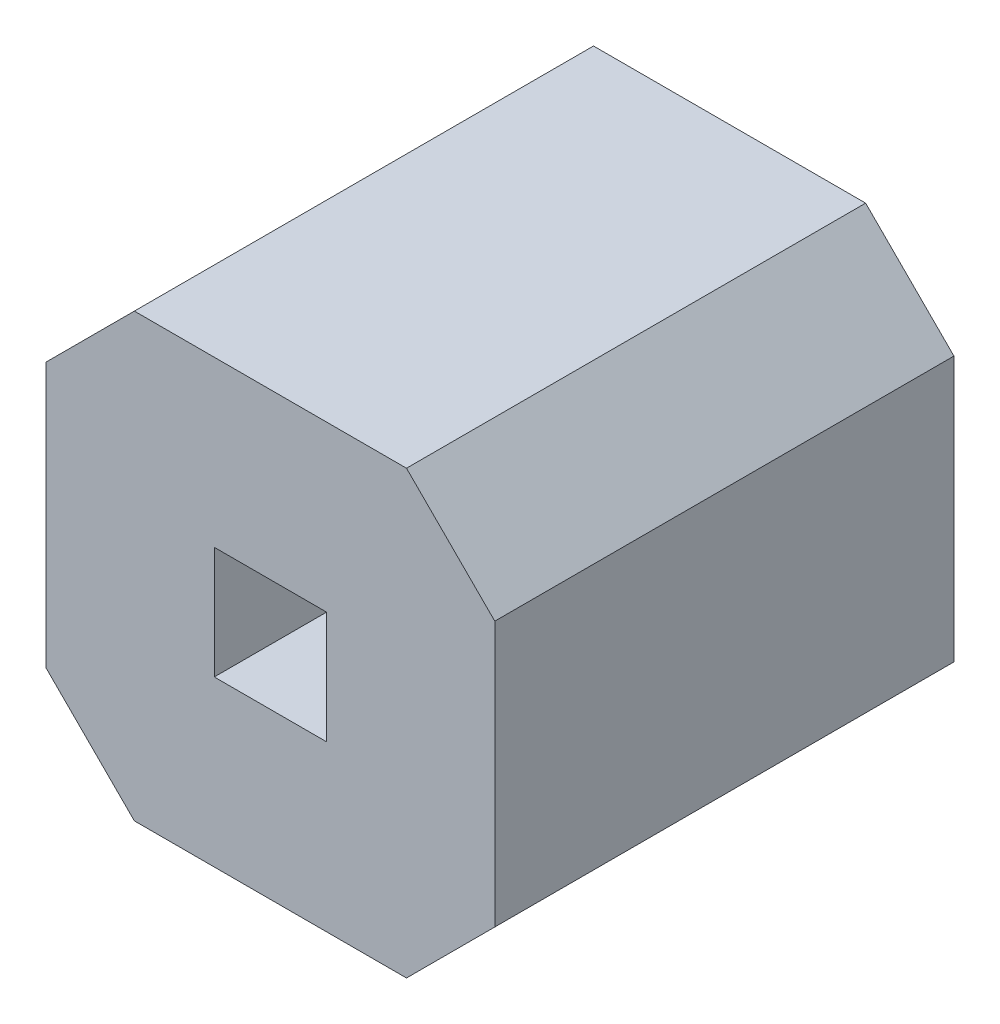
ISO-10303-21;
HEADER;
FILE_DESCRIPTION(('STEP AP214'),'2;1');
FILE_NAME('part.step','',(''),(''),'','','');
FILE_SCHEMA(('AUTOMOTIVE_DESIGN { 1 0 10303 214 1 1 1 1 }'));
ENDSEC;
DATA;
#1=APPLICATION_CONTEXT('core data for automotive mechanical design processes');
#2=APPLICATION_PROTOCOL_DEFINITION('international standard','automotive_design',2000,#1);
#3=PRODUCT_CONTEXT('',#1,'mechanical');
#4=PRODUCT('Part','Part','',(#3));
#5=PRODUCT_RELATED_PRODUCT_CATEGORY('part','',(#4));
#6=PRODUCT_DEFINITION_FORMATION('','',#4);
#7=PRODUCT_DEFINITION_CONTEXT('part definition',#1,'design');
#8=PRODUCT_DEFINITION('design','',#6,#7);
#9=PRODUCT_DEFINITION_SHAPE('','',#8);
#10=(LENGTH_UNIT() NAMED_UNIT(*) SI_UNIT(.MILLI.,.METRE.));
#11=(NAMED_UNIT(*) PLANE_ANGLE_UNIT() SI_UNIT($,.RADIAN.));
#12=(NAMED_UNIT(*) SI_UNIT($,.STERADIAN.) SOLID_ANGLE_UNIT());
#13=UNCERTAINTY_MEASURE_WITH_UNIT(LENGTH_MEASURE(1.E-05),#10,'distance_accuracy_value','');
#14=(GEOMETRIC_REPRESENTATION_CONTEXT(3) GLOBAL_UNCERTAINTY_ASSIGNED_CONTEXT((#13)) GLOBAL_UNIT_ASSIGNED_CONTEXT((#10,
#11,#12)) REPRESENTATION_CONTEXT('',''));
#15=CARTESIAN_POINT('',(0.,0.,0.));
#16=DIRECTION('',(0.,0.,1.));
#17=DIRECTION('',(1.,0.,0.));
#18=AXIS2_PLACEMENT_3D('',#15,#16,#17);
#19=CARTESIAN_POINT('',(0.,0.,2.6));
#20=DIRECTION('',(0.,0.,1.));
#21=DIRECTION('',(1.,0.,0.));
#22=AXIS2_PLACEMENT_3D('',#19,#20,#21);
#23=PLANE('',#22);
#24=DIRECTION('',(1.,0.,0.));
#25=VECTOR('',#24,1.);
#26=CARTESIAN_POINT('',(0.,-2.5,2.6));
#27=LINE('',#26,#25);
#28=CARTESIAN_POINT('',(0.499999999999999,-2.5,2.6));
#29=VERTEX_POINT('',#28);
#30=CARTESIAN_POINT('',(2.041,-2.5,2.6));
#31=VERTEX_POINT('',#30);
#32=EDGE_CURVE('E172',#29,#31,#27,.T.);
#33=ORIENTED_EDGE('',*,*,#32,.T.);
#34=DIRECTION('',(-0.707106781186549,-0.707106781186546,0.));
#35=VECTOR('',#34,1.);
#36=CARTESIAN_POINT('',(2.2705,-2.2705,2.6));
#37=LINE('',#36,#35);
#38=CARTESIAN_POINT('',(2.541,-2.,2.6));
#39=VERTEX_POINT('',#38);
#40=EDGE_CURVE('E212',#31,#39,#37,.F.);
#41=ORIENTED_EDGE('',*,*,#40,.T.);
#42=DIRECTION('',(0.,1.,0.));
#43=VECTOR('',#42,1.);
#44=CARTESIAN_POINT('',(2.541,0.,2.6));
#45=LINE('',#44,#43);
#46=CARTESIAN_POINT('',(2.541,-0.500000000000001,2.6));
#47=VERTEX_POINT('',#46);
#48=EDGE_CURVE('E176',#39,#47,#45,.T.);
#49=ORIENTED_EDGE('',*,*,#48,.T.);
#50=DIRECTION('',(0.707106781186546,-0.707106781186549,0.));
#51=VECTOR('',#50,1.);
#52=CARTESIAN_POINT('',(1.0205,1.0205,2.6));
#53=LINE('',#52,#51);
#54=CARTESIAN_POINT('',(2.041,0.,2.6));
#55=VERTEX_POINT('',#54);
#56=EDGE_CURVE('E59',#47,#55,#53,.F.);
#57=ORIENTED_EDGE('',*,*,#56,.T.);
#58=DIRECTION('',(-1.,0.,0.));
#59=VECTOR('',#58,1.);
#60=CARTESIAN_POINT('',(0.,0.,2.6));
#61=LINE('',#60,#59);
#62=CARTESIAN_POINT('',(0.500000000000001,0.,2.6));
#63=VERTEX_POINT('',#62);
#64=EDGE_CURVE('E178',#55,#63,#61,.T.);
#65=ORIENTED_EDGE('',*,*,#64,.T.);
#66=DIRECTION('',(0.707106781186549,0.707106781186546,0.));
#67=VECTOR('',#66,1.);
#68=CARTESIAN_POINT('',(0.25,-0.25,2.6));
#69=LINE('',#68,#67);
#70=CARTESIAN_POINT('',(0.,-0.499999999999999,2.6));
#71=VERTEX_POINT('',#70);
#72=EDGE_CURVE('E207',#63,#71,#69,.F.);
#73=ORIENTED_EDGE('',*,*,#72,.T.);
#74=DIRECTION('',(0.,-1.,0.));
#75=VECTOR('',#74,1.);
#76=CARTESIAN_POINT('',(0.,0.,2.6));
#77=LINE('',#76,#75);
#78=CARTESIAN_POINT('',(0.,-2.,2.6));
#79=VERTEX_POINT('',#78);
#80=EDGE_CURVE('E169',#71,#79,#77,.T.);
#81=ORIENTED_EDGE('',*,*,#80,.T.);
#82=DIRECTION('',(-0.707106781186546,0.707106781186549,0.));
#83=VECTOR('',#82,1.);
#84=CARTESIAN_POINT('',(-1.,-0.999999999999996,2.6));
#85=LINE('',#84,#83);
#86=EDGE_CURVE('E209',#79,#29,#85,.F.);
#87=ORIENTED_EDGE('',*,*,#86,.T.);
#88=EDGE_LOOP('',(#33,#41,#49,#57,#65,#73,#81,#87));
#89=FACE_BOUND('',#88,.T.);
#90=DIRECTION('',(1.,0.,0.));
#91=VECTOR('',#90,1.);
#92=CARTESIAN_POINT('',(0.9525,-1.568,2.6));
#93=LINE('',#92,#91);
#94=CARTESIAN_POINT('',(0.9525,-1.568,2.6));
#95=VERTEX_POINT('',#94);
#96=CARTESIAN_POINT('',(1.5885,-1.568,2.6));
#97=VERTEX_POINT('',#96);
#98=EDGE_CURVE('E138',#95,#97,#93,.T.);
#99=ORIENTED_EDGE('',*,*,#98,.F.);
#100=DIRECTION('',(0.,-1.,0.));
#101=VECTOR('',#100,1.);
#102=CARTESIAN_POINT('',(0.9525,-0.932,2.6));
#103=LINE('',#102,#101);
#104=CARTESIAN_POINT('',(0.9525,-0.932,2.6));
#105=VERTEX_POINT('',#104);
#106=EDGE_CURVE('E128',#105,#95,#103,.T.);
#107=ORIENTED_EDGE('',*,*,#106,.F.);
#108=DIRECTION('',(-1.,0.,0.));
#109=VECTOR('',#108,1.);
#110=CARTESIAN_POINT('',(0.9525,-0.932,2.6));
#111=LINE('',#110,#109);
#112=CARTESIAN_POINT('',(1.5885,-0.932,2.6));
#113=VERTEX_POINT('',#112);
#114=EDGE_CURVE('E153',#113,#105,#111,.T.);
#115=ORIENTED_EDGE('',*,*,#114,.F.);
#116=DIRECTION('',(0.,1.,0.));
#117=VECTOR('',#116,1.);
#118=CARTESIAN_POINT('',(1.5885,-0.932,2.6));
#119=LINE('',#118,#117);
#120=EDGE_CURVE('E151',#97,#113,#119,.T.);
#121=ORIENTED_EDGE('',*,*,#120,.F.);
#122=EDGE_LOOP('',(#99,#107,#115,#121));
#123=FACE_BOUND('',#122,.T.);
#124=ADVANCED_FACE('F37',(#89,#123),#23,.T.);
#125=CARTESIAN_POINT('',(0.,0.,0.));
#126=DIRECTION('',(0.,0.,1.));
#127=DIRECTION('',(1.,0.,0.));
#128=AXIS2_PLACEMENT_3D('',#125,#126,#127);
#129=PLANE('',#128);
#130=DIRECTION('',(0.,1.,0.));
#131=VECTOR('',#130,1.);
#132=CARTESIAN_POINT('',(2.541,0.,0.));
#133=LINE('',#132,#131);
#134=CARTESIAN_POINT('',(2.541,-2.,0.));
#135=VERTEX_POINT('',#134);
#136=CARTESIAN_POINT('',(2.541,-0.500000000000001,0.));
#137=VERTEX_POINT('',#136);
#138=EDGE_CURVE('E186',#135,#137,#133,.T.);
#139=ORIENTED_EDGE('',*,*,#138,.F.);
#140=DIRECTION('',(0.707106781186549,0.707106781186546,0.));
#141=VECTOR('',#140,1.);
#142=CARTESIAN_POINT('',(2.541,-2.,0.));
#143=LINE('',#142,#141);
#144=CARTESIAN_POINT('',(2.041,-2.5,0.));
#145=VERTEX_POINT('',#144);
#146=EDGE_CURVE('E200',#135,#145,#143,.F.);
#147=ORIENTED_EDGE('',*,*,#146,.T.);
#148=DIRECTION('',(1.,0.,0.));
#149=VECTOR('',#148,1.);
#150=CARTESIAN_POINT('',(0.,-2.5,0.));
#151=LINE('',#150,#149);
#152=CARTESIAN_POINT('',(0.499999999999999,-2.5,0.));
#153=VERTEX_POINT('',#152);
#154=EDGE_CURVE('E183',#153,#145,#151,.T.);
#155=ORIENTED_EDGE('',*,*,#154,.F.);
#156=DIRECTION('',(0.707106781186546,-0.707106781186549,0.));
#157=VECTOR('',#156,1.);
#158=CARTESIAN_POINT('',(0.499999999999999,-2.5,0.));
#159=LINE('',#158,#157);
#160=CARTESIAN_POINT('',(0.,-2.,0.));
#161=VERTEX_POINT('',#160);
#162=EDGE_CURVE('E196',#153,#161,#159,.F.);
#163=ORIENTED_EDGE('',*,*,#162,.T.);
#164=DIRECTION('',(0.,-1.,0.));
#165=VECTOR('',#164,1.);
#166=CARTESIAN_POINT('',(0.,0.,0.));
#167=LINE('',#166,#165);
#168=CARTESIAN_POINT('',(0.,-0.499999999999999,0.));
#169=VERTEX_POINT('',#168);
#170=EDGE_CURVE('E146',#169,#161,#167,.T.);
#171=ORIENTED_EDGE('',*,*,#170,.F.);
#172=DIRECTION('',(-0.707106781186549,-0.707106781186546,0.));
#173=VECTOR('',#172,1.);
#174=CARTESIAN_POINT('',(0.,-0.499999999999999,0.));
#175=LINE('',#174,#173);
#176=CARTESIAN_POINT('',(0.500000000000001,0.,0.));
#177=VERTEX_POINT('',#176);
#178=EDGE_CURVE('E194',#169,#177,#175,.F.);
#179=ORIENTED_EDGE('',*,*,#178,.T.);
#180=DIRECTION('',(-1.,0.,0.));
#181=VECTOR('',#180,1.);
#182=CARTESIAN_POINT('',(0.,0.,0.));
#183=LINE('',#182,#181);
#184=CARTESIAN_POINT('',(2.041,0.,0.));
#185=VERTEX_POINT('',#184);
#186=EDGE_CURVE('E173',#185,#177,#183,.T.);
#187=ORIENTED_EDGE('',*,*,#186,.F.);
#188=DIRECTION('',(-0.707106781186546,0.707106781186549,0.));
#189=VECTOR('',#188,1.);
#190=CARTESIAN_POINT('',(2.041,0.,0.));
#191=LINE('',#190,#189);
#192=EDGE_CURVE('E198',#185,#137,#191,.F.);
#193=ORIENTED_EDGE('',*,*,#192,.T.);
#194=EDGE_LOOP('',(#139,#147,#155,#163,#171,#179,#187,#193));
#195=FACE_BOUND('',#194,.T.);
#196=DIRECTION('',(0.,-1.,0.));
#197=VECTOR('',#196,1.);
#198=CARTESIAN_POINT('',(0.9525,-0.932,0.));
#199=LINE('',#198,#197);
#200=CARTESIAN_POINT('',(0.9525,-0.932,0.));
#201=VERTEX_POINT('',#200);
#202=CARTESIAN_POINT('',(0.9525,-1.568,0.));
#203=VERTEX_POINT('',#202);
#204=EDGE_CURVE('E157',#201,#203,#199,.T.);
#205=ORIENTED_EDGE('',*,*,#204,.T.);
#206=DIRECTION('',(1.,0.,0.));
#207=VECTOR('',#206,1.);
#208=CARTESIAN_POINT('',(0.9525,-1.568,0.));
#209=LINE('',#208,#207);
#210=CARTESIAN_POINT('',(1.5885,-1.568,0.));
#211=VERTEX_POINT('',#210);
#212=EDGE_CURVE('E145',#203,#211,#209,.T.);
#213=ORIENTED_EDGE('',*,*,#212,.T.);
#214=DIRECTION('',(0.,1.,0.));
#215=VECTOR('',#214,1.);
#216=CARTESIAN_POINT('',(1.5885,-0.932,0.));
#217=LINE('',#216,#215);
#218=CARTESIAN_POINT('',(1.5885,-0.932,0.));
#219=VERTEX_POINT('',#218);
#220=EDGE_CURVE('E160',#211,#219,#217,.T.);
#221=ORIENTED_EDGE('',*,*,#220,.T.);
#222=DIRECTION('',(-1.,0.,0.));
#223=VECTOR('',#222,1.);
#224=CARTESIAN_POINT('',(0.9525,-0.932,0.));
#225=LINE('',#224,#223);
#226=EDGE_CURVE('E139',#219,#201,#225,.T.);
#227=ORIENTED_EDGE('',*,*,#226,.T.);
#228=EDGE_LOOP('',(#205,#213,#221,#227));
#229=FACE_BOUND('',#228,.T.);
#230=ADVANCED_FACE('F228',(#195,#229),#129,.F.);
#231=CARTESIAN_POINT('',(0.,0.,2.6));
#232=DIRECTION('',(1.,0.,0.));
#233=DIRECTION('',(0.,1.,0.));
#234=AXIS2_PLACEMENT_3D('',#231,#232,#233);
#235=PLANE('',#234);
#236=ORIENTED_EDGE('',*,*,#170,.T.);
#237=DIRECTION('',(0.,0.,1.));
#238=VECTOR('',#237,1.);
#239=CARTESIAN_POINT('',(0.,-2.,2.6));
#240=LINE('',#239,#238);
#241=EDGE_CURVE('E11',#161,#79,#240,.T.);
#242=ORIENTED_EDGE('',*,*,#241,.T.);
#243=ORIENTED_EDGE('',*,*,#80,.F.);
#244=DIRECTION('',(0.,0.,-1.));
#245=VECTOR('',#244,1.);
#246=CARTESIAN_POINT('',(0.,-0.499999999999999,2.6));
#247=LINE('',#246,#245);
#248=EDGE_CURVE('E45',#71,#169,#247,.T.);
#249=ORIENTED_EDGE('',*,*,#248,.T.);
#250=EDGE_LOOP('',(#236,#242,#243,#249));
#251=FACE_BOUND('',#250,.T.);
#252=ADVANCED_FACE('F222',(#251),#235,.F.);
#253=CARTESIAN_POINT('',(0.,-2.5,2.6));
#254=DIRECTION('',(0.,1.,0.));
#255=DIRECTION('',(0.,0.,1.));
#256=AXIS2_PLACEMENT_3D('',#253,#254,#255);
#257=PLANE('',#256);
#258=ORIENTED_EDGE('',*,*,#154,.T.);
#259=DIRECTION('',(0.,0.,1.));
#260=VECTOR('',#259,1.);
#261=CARTESIAN_POINT('',(2.041,-2.5,2.6));
#262=LINE('',#261,#260);
#263=EDGE_CURVE('E205',#145,#31,#262,.T.);
#264=ORIENTED_EDGE('',*,*,#263,.T.);
#265=ORIENTED_EDGE('',*,*,#32,.F.);
#266=DIRECTION('',(0.,0.,-1.));
#267=VECTOR('',#266,1.);
#268=CARTESIAN_POINT('',(0.499999999999999,-2.5,2.6));
#269=LINE('',#268,#267);
#270=EDGE_CURVE('E202',#29,#153,#269,.T.);
#271=ORIENTED_EDGE('',*,*,#270,.T.);
#272=EDGE_LOOP('',(#258,#264,#265,#271));
#273=FACE_BOUND('',#272,.T.);
#274=ADVANCED_FACE('F238',(#273),#257,.F.);
#275=CARTESIAN_POINT('',(2.541,0.,2.6));
#276=DIRECTION('',(-1.,0.,0.));
#277=DIRECTION('',(0.,0.,1.));
#278=AXIS2_PLACEMENT_3D('',#275,#276,#277);
#279=PLANE('',#278);
#280=ORIENTED_EDGE('',*,*,#48,.F.);
#281=DIRECTION('',(0.,0.,-1.));
#282=VECTOR('',#281,1.);
#283=CARTESIAN_POINT('',(2.541,-2.,2.6));
#284=LINE('',#283,#282);
#285=EDGE_CURVE('E191',#39,#135,#284,.T.);
#286=ORIENTED_EDGE('',*,*,#285,.T.);
#287=ORIENTED_EDGE('',*,*,#138,.T.);
#288=DIRECTION('',(0.,0.,1.));
#289=VECTOR('',#288,1.);
#290=CARTESIAN_POINT('',(2.541,-0.500000000000001,2.6));
#291=LINE('',#290,#289);
#292=EDGE_CURVE('E180',#137,#47,#291,.T.);
#293=ORIENTED_EDGE('',*,*,#292,.T.);
#294=EDGE_LOOP('',(#280,#286,#287,#293));
#295=FACE_BOUND('',#294,.T.);
#296=ADVANCED_FACE('F246',(#295),#279,.F.);
#297=CARTESIAN_POINT('',(0.,0.,2.6));
#298=DIRECTION('',(0.,-1.,0.));
#299=DIRECTION('',(0.,0.,-1.));
#300=AXIS2_PLACEMENT_3D('',#297,#298,#299);
#301=PLANE('',#300);
#302=ORIENTED_EDGE('',*,*,#64,.F.);
#303=DIRECTION('',(0.,0.,-1.));
#304=VECTOR('',#303,1.);
#305=CARTESIAN_POINT('',(2.041,0.,2.6));
#306=LINE('',#305,#304);
#307=EDGE_CURVE('E215',#55,#185,#306,.T.);
#308=ORIENTED_EDGE('',*,*,#307,.T.);
#309=ORIENTED_EDGE('',*,*,#186,.T.);
#310=DIRECTION('',(0.,0.,1.));
#311=VECTOR('',#310,1.);
#312=CARTESIAN_POINT('',(0.500000000000001,0.,2.6));
#313=LINE('',#312,#311);
#314=EDGE_CURVE('E52',#177,#63,#313,.T.);
#315=ORIENTED_EDGE('',*,*,#314,.T.);
#316=EDGE_LOOP('',(#302,#308,#309,#315));
#317=FACE_BOUND('',#316,.T.);
#318=ADVANCED_FACE('F251',(#317),#301,.F.);
#319=CARTESIAN_POINT('',(0.9525,-0.932,2.6));
#320=DIRECTION('',(1.,0.,0.));
#321=DIRECTION('',(0.,1.,0.));
#322=AXIS2_PLACEMENT_3D('',#319,#320,#321);
#323=PLANE('',#322);
#324=ORIENTED_EDGE('',*,*,#204,.F.);
#325=DIRECTION('',(0.,0.,-1.));
#326=VECTOR('',#325,1.);
#327=CARTESIAN_POINT('',(0.9525,-0.932,2.6));
#328=LINE('',#327,#326);
#329=EDGE_CURVE('E134',#105,#201,#328,.T.);
#330=ORIENTED_EDGE('',*,*,#329,.F.);
#331=ORIENTED_EDGE('',*,*,#106,.T.);
#332=DIRECTION('',(0.,0.,-1.));
#333=VECTOR('',#332,1.);
#334=CARTESIAN_POINT('',(0.9525,-1.568,2.6));
#335=LINE('',#334,#333);
#336=EDGE_CURVE('E131',#95,#203,#335,.T.);
#337=ORIENTED_EDGE('',*,*,#336,.T.);
#338=EDGE_LOOP('',(#324,#330,#331,#337));
#339=FACE_BOUND('',#338,.T.);
#340=ADVANCED_FACE('F130',(#339),#323,.T.);
#341=CARTESIAN_POINT('',(0.9525,-1.568,2.6));
#342=DIRECTION('',(0.,1.,0.));
#343=DIRECTION('',(0.,0.,1.));
#344=AXIS2_PLACEMENT_3D('',#341,#342,#343);
#345=PLANE('',#344);
#346=ORIENTED_EDGE('',*,*,#212,.F.);
#347=ORIENTED_EDGE('',*,*,#336,.F.);
#348=ORIENTED_EDGE('',*,*,#98,.T.);
#349=DIRECTION('',(0.,0.,-1.));
#350=VECTOR('',#349,1.);
#351=CARTESIAN_POINT('',(1.5885,-1.568,2.6));
#352=LINE('',#351,#350);
#353=EDGE_CURVE('E147',#97,#211,#352,.T.);
#354=ORIENTED_EDGE('',*,*,#353,.T.);
#355=EDGE_LOOP('',(#346,#347,#348,#354));
#356=FACE_BOUND('',#355,.T.);
#357=ADVANCED_FACE('F142',(#356),#345,.T.);
#358=CARTESIAN_POINT('',(1.5885,-0.932,2.6));
#359=DIRECTION('',(-1.,0.,0.));
#360=DIRECTION('',(0.,-1.,0.));
#361=AXIS2_PLACEMENT_3D('',#358,#359,#360);
#362=PLANE('',#361);
#363=ORIENTED_EDGE('',*,*,#220,.F.);
#364=ORIENTED_EDGE('',*,*,#353,.F.);
#365=ORIENTED_EDGE('',*,*,#120,.T.);
#366=DIRECTION('',(0.,0.,-1.));
#367=VECTOR('',#366,1.);
#368=CARTESIAN_POINT('',(1.5885,-0.932,2.6));
#369=LINE('',#368,#367);
#370=EDGE_CURVE('E166',#113,#219,#369,.T.);
#371=ORIENTED_EDGE('',*,*,#370,.T.);
#372=EDGE_LOOP('',(#363,#364,#365,#371));
#373=FACE_BOUND('',#372,.T.);
#374=ADVANCED_FACE('F306',(#373),#362,.T.);
#375=CARTESIAN_POINT('',(0.9525,-0.932,2.6));
#376=DIRECTION('',(0.,-1.,0.));
#377=DIRECTION('',(1.,0.,0.));
#378=AXIS2_PLACEMENT_3D('',#375,#376,#377);
#379=PLANE('',#378);
#380=ORIENTED_EDGE('',*,*,#226,.F.);
#381=ORIENTED_EDGE('',*,*,#370,.F.);
#382=ORIENTED_EDGE('',*,*,#114,.T.);
#383=ORIENTED_EDGE('',*,*,#329,.T.);
#384=EDGE_LOOP('',(#380,#381,#382,#383));
#385=FACE_BOUND('',#384,.T.);
#386=ADVANCED_FACE('F275',(#385),#379,.T.);
#387=CARTESIAN_POINT('',(2.541,-2.,2.6));
#388=DIRECTION('',(-0.707106781186546,0.707106781186549,0.));
#389=DIRECTION('',(0.,0.,-1.));
#390=AXIS2_PLACEMENT_3D('',#387,#388,#389);
#391=PLANE('',#390);
#392=ORIENTED_EDGE('',*,*,#40,.F.);
#393=ORIENTED_EDGE('',*,*,#263,.F.);
#394=ORIENTED_EDGE('',*,*,#146,.F.);
#395=ORIENTED_EDGE('',*,*,#285,.F.);
#396=EDGE_LOOP('',(#392,#393,#394,#395));
#397=FACE_BOUND('',#396,.T.);
#398=ADVANCED_FACE('F244',(#397),#391,.F.);
#399=CARTESIAN_POINT('',(2.041,0.,2.6));
#400=DIRECTION('',(-0.707106781186549,-0.707106781186546,0.));
#401=DIRECTION('',(0.,0.,-1.));
#402=AXIS2_PLACEMENT_3D('',#399,#400,#401);
#403=PLANE('',#402);
#404=ORIENTED_EDGE('',*,*,#56,.F.);
#405=ORIENTED_EDGE('',*,*,#292,.F.);
#406=ORIENTED_EDGE('',*,*,#192,.F.);
#407=ORIENTED_EDGE('',*,*,#307,.F.);
#408=EDGE_LOOP('',(#404,#405,#406,#407));
#409=FACE_BOUND('',#408,.T.);
#410=ADVANCED_FACE('F250',(#409),#403,.F.);
#411=CARTESIAN_POINT('',(0.499999999999999,-2.5,2.6));
#412=DIRECTION('',(0.707106781186549,0.707106781186546,0.));
#413=DIRECTION('',(0.,0.,-1.));
#414=AXIS2_PLACEMENT_3D('',#411,#412,#413);
#415=PLANE('',#414);
#416=ORIENTED_EDGE('',*,*,#86,.F.);
#417=ORIENTED_EDGE('',*,*,#241,.F.);
#418=ORIENTED_EDGE('',*,*,#162,.F.);
#419=ORIENTED_EDGE('',*,*,#270,.F.);
#420=EDGE_LOOP('',(#416,#417,#418,#419));
#421=FACE_BOUND('',#420,.T.);
#422=ADVANCED_FACE('F235',(#421),#415,.F.);
#423=CARTESIAN_POINT('',(0.,-0.499999999999999,2.6));
#424=DIRECTION('',(0.707106781186546,-0.707106781186549,0.));
#425=DIRECTION('',(0.,0.,-1.));
#426=AXIS2_PLACEMENT_3D('',#423,#424,#425);
#427=PLANE('',#426);
#428=ORIENTED_EDGE('',*,*,#72,.F.);
#429=ORIENTED_EDGE('',*,*,#314,.F.);
#430=ORIENTED_EDGE('',*,*,#178,.F.);
#431=ORIENTED_EDGE('',*,*,#248,.F.);
#432=EDGE_LOOP('',(#428,#429,#430,#431));
#433=FACE_BOUND('',#432,.T.);
#434=ADVANCED_FACE('F39',(#433),#427,.F.);
#435=CLOSED_SHELL('',(#124,#230,#252,#274,#296,#318,#340,#357,#374,#386,#398,#410,#422,#434));
#436=MANIFOLD_SOLID_BREP('B2',#435);
#437=ADVANCED_BREP_SHAPE_REPRESENTATION('',(#18,#436),#14);
#438=SHAPE_DEFINITION_REPRESENTATION(#9,#437);
ENDSEC;
END-ISO-10303-21;
